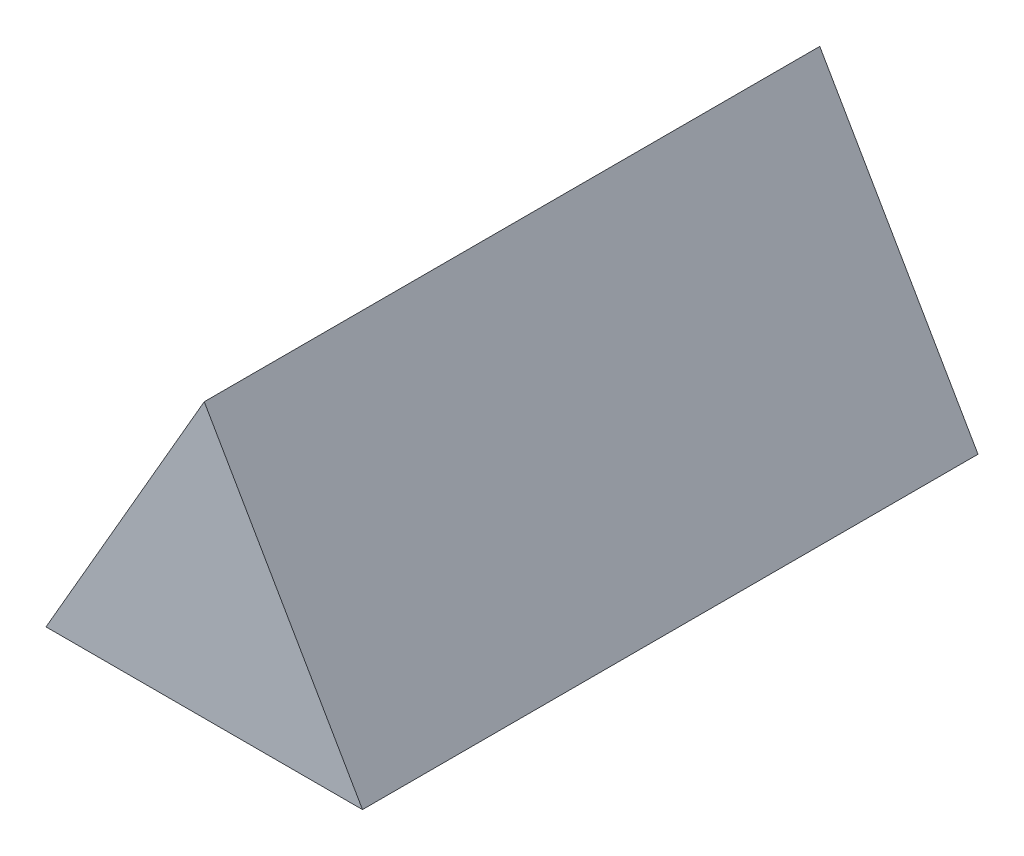
ISO-10303-21;
HEADER;
FILE_DESCRIPTION(('STEP AP214'),'2;1');
FILE_NAME('part.step','',(''),(''),'','','');
FILE_SCHEMA(('AUTOMOTIVE_DESIGN { 1 0 10303 214 1 1 1 1 }'));
ENDSEC;
DATA;
#1=APPLICATION_CONTEXT('core data for automotive mechanical design processes');
#2=APPLICATION_PROTOCOL_DEFINITION('international standard','automotive_design',2000,#1);
#3=PRODUCT_CONTEXT('',#1,'mechanical');
#4=PRODUCT('Part','Part','',(#3));
#5=PRODUCT_RELATED_PRODUCT_CATEGORY('part','',(#4));
#6=PRODUCT_DEFINITION_FORMATION('','',#4);
#7=PRODUCT_DEFINITION_CONTEXT('part definition',#1,'design');
#8=PRODUCT_DEFINITION('design','',#6,#7);
#9=PRODUCT_DEFINITION_SHAPE('','',#8);
#10=(LENGTH_UNIT() NAMED_UNIT(*) SI_UNIT(.MILLI.,.METRE.));
#11=(NAMED_UNIT(*) PLANE_ANGLE_UNIT() SI_UNIT($,.RADIAN.));
#12=(NAMED_UNIT(*) SI_UNIT($,.STERADIAN.) SOLID_ANGLE_UNIT());
#13=UNCERTAINTY_MEASURE_WITH_UNIT(LENGTH_MEASURE(1.E-05),#10,'distance_accuracy_value','');
#14=(GEOMETRIC_REPRESENTATION_CONTEXT(3) GLOBAL_UNCERTAINTY_ASSIGNED_CONTEXT((#13)) GLOBAL_UNIT_ASSIGNED_CONTEXT((#10,
#11,#12)) REPRESENTATION_CONTEXT('',''));
#15=CARTESIAN_POINT('',(0.,0.,0.));
#16=DIRECTION('',(0.,0.,1.));
#17=DIRECTION('',(1.,0.,0.));
#18=AXIS2_PLACEMENT_3D('',#15,#16,#17);
#19=CARTESIAN_POINT('',(41.1362066797609,-23.75,160.));
#20=DIRECTION('',(-0.866025403784438,-0.5,0.));
#21=DIRECTION('',(0.5,-0.866025403784438,0.));
#22=AXIS2_PLACEMENT_3D('',#19,#20,#21);
#23=PLANE('',#22);
#24=DIRECTION('',(-0.5,0.866025403784438,0.));
#25=VECTOR('',#24,1.);
#26=CARTESIAN_POINT('',(41.1362066797609,-23.75,0.));
#27=LINE('',#26,#25);
#28=CARTESIAN_POINT('',(41.1362066797609,-23.75,0.));
#29=VERTEX_POINT('',#28);
#30=CARTESIAN_POINT('',(0.,47.5,0.));
#31=VERTEX_POINT('',#30);
#32=EDGE_CURVE('E80',#29,#31,#27,.T.);
#33=ORIENTED_EDGE('',*,*,#32,.T.);
#34=DIRECTION('',(0.,0.,-1.));
#35=VECTOR('',#34,1.);
#36=CARTESIAN_POINT('',(0.,47.5,160.));
#37=LINE('',#36,#35);
#38=CARTESIAN_POINT('',(0.,47.5,160.));
#39=VERTEX_POINT('',#38);
#40=EDGE_CURVE('E11',#39,#31,#37,.T.);
#41=ORIENTED_EDGE('',*,*,#40,.F.);
#42=DIRECTION('',(-0.5,0.866025403784438,0.));
#43=VECTOR('',#42,1.);
#44=CARTESIAN_POINT('',(41.1362066797609,-23.75,160.));
#45=LINE('',#44,#43);
#46=CARTESIAN_POINT('',(41.1362066797609,-23.75,160.));
#47=VERTEX_POINT('',#46);
#48=EDGE_CURVE('E73',#47,#39,#45,.T.);
#49=ORIENTED_EDGE('',*,*,#48,.F.);
#50=DIRECTION('',(0.,0.,-1.));
#51=VECTOR('',#50,1.);
#52=CARTESIAN_POINT('',(41.1362066797609,-23.75,160.));
#53=LINE('',#52,#51);
#54=EDGE_CURVE('E81',#47,#29,#53,.T.);
#55=ORIENTED_EDGE('',*,*,#54,.T.);
#56=EDGE_LOOP('',(#33,#41,#49,#55));
#57=FACE_BOUND('',#56,.T.);
#58=ADVANCED_FACE('F33',(#57),#23,.F.);
#59=CARTESIAN_POINT('',(0.,47.5,160.));
#60=DIRECTION('',(0.866025403784439,-0.5,0.));
#61=DIRECTION('',(0.5,0.866025403784439,0.));
#62=AXIS2_PLACEMENT_3D('',#59,#60,#61);
#63=PLANE('',#62);
#64=DIRECTION('',(-0.5,-0.866025403784439,0.));
#65=VECTOR('',#64,1.);
#66=CARTESIAN_POINT('',(0.,47.5,0.));
#67=LINE('',#66,#65);
#68=CARTESIAN_POINT('',(-41.1362066797608,-23.75,0.));
#69=VERTEX_POINT('',#68);
#70=EDGE_CURVE('E61',#31,#69,#67,.T.);
#71=ORIENTED_EDGE('',*,*,#70,.T.);
#72=DIRECTION('',(0.,0.,-1.));
#73=VECTOR('',#72,1.);
#74=CARTESIAN_POINT('',(-41.1362066797608,-23.75,160.));
#75=LINE('',#74,#73);
#76=CARTESIAN_POINT('',(-41.1362066797608,-23.75,160.));
#77=VERTEX_POINT('',#76);
#78=EDGE_CURVE('E41',#77,#69,#75,.T.);
#79=ORIENTED_EDGE('',*,*,#78,.F.);
#80=DIRECTION('',(-0.5,-0.866025403784439,0.));
#81=VECTOR('',#80,1.);
#82=CARTESIAN_POINT('',(0.,47.5,160.));
#83=LINE('',#82,#81);
#84=EDGE_CURVE('E69',#39,#77,#83,.T.);
#85=ORIENTED_EDGE('',*,*,#84,.F.);
#86=ORIENTED_EDGE('',*,*,#40,.T.);
#87=EDGE_LOOP('',(#71,#79,#85,#86));
#88=FACE_BOUND('',#87,.T.);
#89=ADVANCED_FACE('F70',(#88),#63,.F.);
#90=CARTESIAN_POINT('',(-41.1362066797608,-23.75,160.));
#91=DIRECTION('',(0.,1.,0.));
#92=DIRECTION('',(-1.,0.,0.));
#93=AXIS2_PLACEMENT_3D('',#90,#91,#92);
#94=PLANE('',#93);
#95=DIRECTION('',(1.,0.,0.));
#96=VECTOR('',#95,1.);
#97=CARTESIAN_POINT('',(-41.1362066797608,-23.75,0.));
#98=LINE('',#97,#96);
#99=EDGE_CURVE('E66',#69,#29,#98,.T.);
#100=ORIENTED_EDGE('',*,*,#99,.T.);
#101=ORIENTED_EDGE('',*,*,#54,.F.);
#102=DIRECTION('',(1.,0.,0.));
#103=VECTOR('',#102,1.);
#104=CARTESIAN_POINT('',(-41.1362066797608,-23.75,160.));
#105=LINE('',#104,#103);
#106=EDGE_CURVE('E49',#77,#47,#105,.T.);
#107=ORIENTED_EDGE('',*,*,#106,.F.);
#108=ORIENTED_EDGE('',*,*,#78,.T.);
#109=EDGE_LOOP('',(#100,#101,#107,#108));
#110=FACE_BOUND('',#109,.T.);
#111=ADVANCED_FACE('F88',(#110),#94,.F.);
#112=CARTESIAN_POINT('',(0.,0.,160.));
#113=DIRECTION('',(0.,0.,1.));
#114=DIRECTION('',(1.,0.,0.));
#115=AXIS2_PLACEMENT_3D('',#112,#113,#114);
#116=PLANE('',#115);
#117=ORIENTED_EDGE('',*,*,#48,.T.);
#118=ORIENTED_EDGE('',*,*,#84,.T.);
#119=ORIENTED_EDGE('',*,*,#106,.T.);
#120=EDGE_LOOP('',(#117,#118,#119));
#121=FACE_BOUND('',#120,.T.);
#122=ADVANCED_FACE('F76',(#121),#116,.T.);
#123=CARTESIAN_POINT('',(0.,0.,0.));
#124=DIRECTION('',(0.,0.,1.));
#125=DIRECTION('',(1.,0.,0.));
#126=AXIS2_PLACEMENT_3D('',#123,#124,#125);
#127=PLANE('',#126);
#128=ORIENTED_EDGE('',*,*,#32,.F.);
#129=ORIENTED_EDGE('',*,*,#99,.F.);
#130=ORIENTED_EDGE('',*,*,#70,.F.);
#131=EDGE_LOOP('',(#128,#129,#130));
#132=FACE_BOUND('',#131,.T.);
#133=ADVANCED_FACE('F89',(#132),#127,.F.);
#134=CLOSED_SHELL('',(#58,#89,#111,#122,#133));
#135=MANIFOLD_SOLID_BREP('B2',#134);
#136=ADVANCED_BREP_SHAPE_REPRESENTATION('',(#18,#135),#14);
#137=SHAPE_DEFINITION_REPRESENTATION(#9,#136);
ENDSEC;
END-ISO-10303-21;
